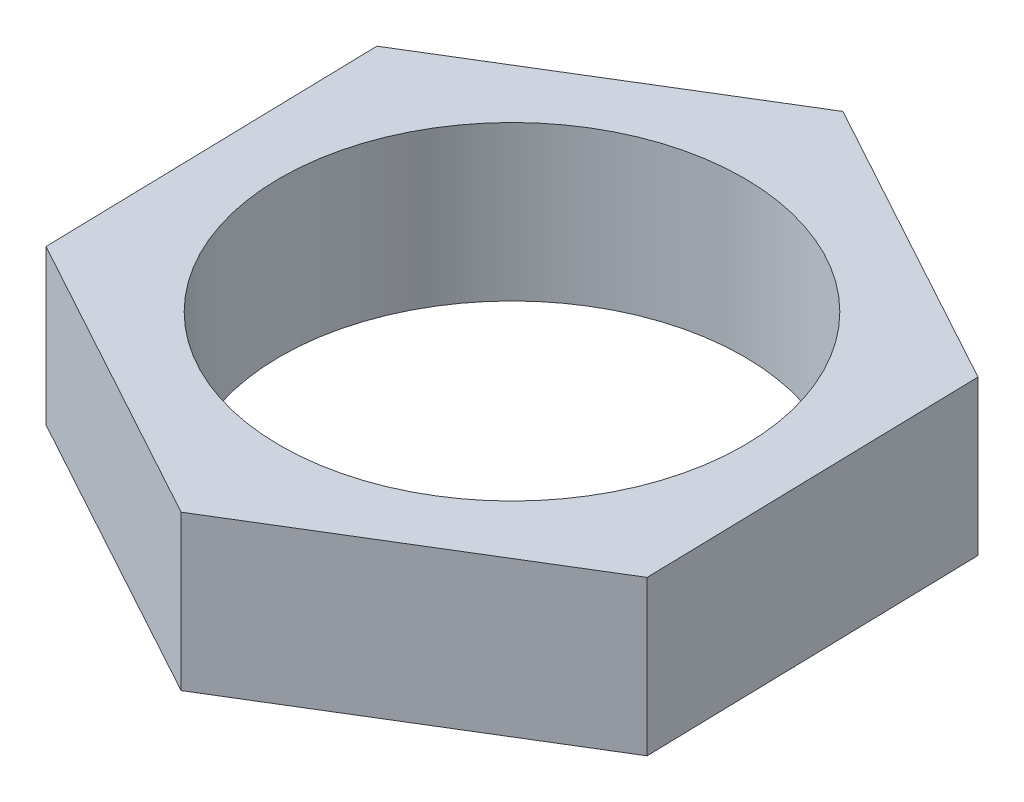
ISO-10303-21;
HEADER;
FILE_DESCRIPTION(('STEP AP214'),'2;1');
FILE_NAME('part.step','',(''),(''),'','','');
FILE_SCHEMA(('AUTOMOTIVE_DESIGN { 1 0 10303 214 1 1 1 1 }'));
ENDSEC;
DATA;
#1=APPLICATION_CONTEXT('core data for automotive mechanical design processes');
#2=APPLICATION_PROTOCOL_DEFINITION('international standard','automotive_design',2000,#1);
#3=PRODUCT_CONTEXT('',#1,'mechanical');
#4=PRODUCT('Part','Part','',(#3));
#5=PRODUCT_RELATED_PRODUCT_CATEGORY('part','',(#4));
#6=PRODUCT_DEFINITION_FORMATION('','',#4);
#7=PRODUCT_DEFINITION_CONTEXT('part definition',#1,'design');
#8=PRODUCT_DEFINITION('design','',#6,#7);
#9=PRODUCT_DEFINITION_SHAPE('','',#8);
#10=(LENGTH_UNIT() NAMED_UNIT(*) SI_UNIT(.MILLI.,.METRE.));
#11=(NAMED_UNIT(*) PLANE_ANGLE_UNIT() SI_UNIT($,.RADIAN.));
#12=(NAMED_UNIT(*) SI_UNIT($,.STERADIAN.) SOLID_ANGLE_UNIT());
#13=UNCERTAINTY_MEASURE_WITH_UNIT(LENGTH_MEASURE(1.E-05),#10,'distance_accuracy_value','');
#14=(GEOMETRIC_REPRESENTATION_CONTEXT(3) GLOBAL_UNCERTAINTY_ASSIGNED_CONTEXT((#13)) GLOBAL_UNIT_ASSIGNED_CONTEXT((#10,
#11,#12)) REPRESENTATION_CONTEXT('',''));
#15=CARTESIAN_POINT('',(0.,0.,0.));
#16=DIRECTION('',(0.,0.,1.));
#17=DIRECTION('',(1.,0.,0.));
#18=AXIS2_PLACEMENT_3D('',#15,#16,#17);
#19=CARTESIAN_POINT('',(9.36650046884318,5.,-5.70981631057372));
#20=DIRECTION('',(-0.479205511966589,0.,0.877702727180928));
#21=DIRECTION('',(0.877702727180928,0.,0.479205511966589));
#22=AXIS2_PLACEMENT_3D('',#19,#20,#21);
#23=PLANE('',#22);
#24=DIRECTION('',(-0.877702727180928,0.,-0.479205511966589));
#25=VECTOR('',#24,1.);
#26=CARTESIAN_POINT('',(9.36650046884318,0.,-5.70981631057372));
#27=LINE('',#26,#25);
#28=CARTESIAN_POINT('',(9.36650046884318,0.,-5.70981631057372));
#29=VERTEX_POINT('',#28);
#30=CARTESIAN_POINT('',(-0.261595741477986,0.,-10.9665355058639));
#31=VERTEX_POINT('',#30);
#32=EDGE_CURVE('E128',#29,#31,#27,.T.);
#33=ORIENTED_EDGE('',*,*,#32,.T.);
#34=DIRECTION('',(0.,-1.,0.));
#35=VECTOR('',#34,1.);
#36=CARTESIAN_POINT('',(-0.261595741477986,5.,-10.9665355058639));
#37=LINE('',#36,#35);
#38=CARTESIAN_POINT('',(-0.261595741477986,5.,-10.9665355058639));
#39=VERTEX_POINT('',#38);
#40=EDGE_CURVE('E11',#39,#31,#37,.T.);
#41=ORIENTED_EDGE('',*,*,#40,.F.);
#42=DIRECTION('',(-0.877702727180928,0.,-0.479205511966589));
#43=VECTOR('',#42,1.);
#44=CARTESIAN_POINT('',(9.36650046884318,5.,-5.70981631057372));
#45=LINE('',#44,#43);
#46=CARTESIAN_POINT('',(9.36650046884318,5.,-5.70981631057372));
#47=VERTEX_POINT('',#46);
#48=EDGE_CURVE('E145',#47,#39,#45,.T.);
#49=ORIENTED_EDGE('',*,*,#48,.F.);
#50=DIRECTION('',(0.,-1.,0.));
#51=VECTOR('',#50,1.);
#52=CARTESIAN_POINT('',(9.36650046884318,5.,-5.70981631057372));
#53=LINE('',#52,#51);
#54=EDGE_CURVE('E124',#47,#29,#53,.T.);
#55=ORIENTED_EDGE('',*,*,#54,.T.);
#56=EDGE_LOOP('',(#33,#41,#49,#55));
#57=FACE_BOUND('',#56,.T.);
#58=ADVANCED_FACE('F39',(#57),#23,.F.);
#59=CARTESIAN_POINT('',(-0.261595741477986,5.,-10.9665355058639));
#60=DIRECTION('',(0.520510102726272,0.,0.853855510587058));
#61=DIRECTION('',(0.853855510587058,0.,-0.520510102726272));
#62=AXIS2_PLACEMENT_3D('',#59,#60,#61);
#63=PLANE('',#62);
#64=DIRECTION('',(-0.853855510587058,0.,0.520510102726272));
#65=VECTOR('',#64,1.);
#66=CARTESIAN_POINT('',(-0.261595741477986,0.,-10.9665355058639));
#67=LINE('',#66,#65);
#68=CARTESIAN_POINT('',(-9.62809621032118,0.,-5.25671919529019));
#69=VERTEX_POINT('',#68);
#70=EDGE_CURVE('E132',#31,#69,#67,.T.);
#71=ORIENTED_EDGE('',*,*,#70,.T.);
#72=DIRECTION('',(0.,-1.,0.));
#73=VECTOR('',#72,1.);
#74=CARTESIAN_POINT('',(-9.62809621032118,5.,-5.25671919529019));
#75=LINE('',#74,#73);
#76=CARTESIAN_POINT('',(-9.62809621032118,5.,-5.25671919529019));
#77=VERTEX_POINT('',#76);
#78=EDGE_CURVE('E48',#77,#69,#75,.T.);
#79=ORIENTED_EDGE('',*,*,#78,.F.);
#80=DIRECTION('',(-0.853855510587058,0.,0.520510102726272));
#81=VECTOR('',#80,1.);
#82=CARTESIAN_POINT('',(-0.261595741477986,5.,-10.9665355058639));
#83=LINE('',#82,#81);
#84=EDGE_CURVE('E93',#39,#77,#83,.T.);
#85=ORIENTED_EDGE('',*,*,#84,.F.);
#86=ORIENTED_EDGE('',*,*,#40,.T.);
#87=EDGE_LOOP('',(#71,#79,#85,#86));
#88=FACE_BOUND('',#87,.T.);
#89=ADVANCED_FACE('F174',(#88),#63,.F.);
#90=CARTESIAN_POINT('',(-9.62809621032118,5.,-5.25671919529019));
#91=DIRECTION('',(0.999715614692861,0.,-0.0238472165938701));
#92=DIRECTION('',(-0.0238472165938701,0.,-0.999715614692861));
#93=AXIS2_PLACEMENT_3D('',#90,#91,#92);
#94=PLANE('',#93);
#95=DIRECTION('',(0.0238472165938701,0.,0.999715614692861));
#96=VECTOR('',#95,1.);
#97=CARTESIAN_POINT('',(-9.62809621032118,0.,-5.25671919529019));
#98=LINE('',#97,#96);
#99=CARTESIAN_POINT('',(-9.36650046884319,0.,5.70981631057372));
#100=VERTEX_POINT('',#99);
#101=EDGE_CURVE('E136',#69,#100,#98,.T.);
#102=ORIENTED_EDGE('',*,*,#101,.T.);
#103=DIRECTION('',(0.,-1.,0.));
#104=VECTOR('',#103,1.);
#105=CARTESIAN_POINT('',(-9.36650046884319,5.,5.70981631057372));
#106=LINE('',#105,#104);
#107=CARTESIAN_POINT('',(-9.36650046884319,5.,5.70981631057372));
#108=VERTEX_POINT('',#107);
#109=EDGE_CURVE('E117',#108,#100,#106,.T.);
#110=ORIENTED_EDGE('',*,*,#109,.F.);
#111=DIRECTION('',(0.0238472165938701,0.,0.999715614692861));
#112=VECTOR('',#111,1.);
#113=CARTESIAN_POINT('',(-9.62809621032118,5.,-5.25671919529019));
#114=LINE('',#113,#112);
#115=EDGE_CURVE('E106',#77,#108,#114,.T.);
#116=ORIENTED_EDGE('',*,*,#115,.F.);
#117=ORIENTED_EDGE('',*,*,#78,.T.);
#118=EDGE_LOOP('',(#102,#110,#116,#117));
#119=FACE_BOUND('',#118,.T.);
#120=ADVANCED_FACE('F155',(#119),#94,.F.);
#121=CARTESIAN_POINT('',(-9.36650046884319,5.,5.70981631057372));
#122=DIRECTION('',(0.47920551196659,0.,-0.877702727180928));
#123=DIRECTION('',(-0.877702727180928,0.,-0.479205511966589));
#124=AXIS2_PLACEMENT_3D('',#121,#122,#123);
#125=PLANE('',#124);
#126=DIRECTION('',(0.877702727180928,0.,0.47920551196659));
#127=VECTOR('',#126,1.);
#128=CARTESIAN_POINT('',(-9.36650046884319,0.,5.70981631057372));
#129=LINE('',#128,#127);
#130=CARTESIAN_POINT('',(0.261595741477987,0.,10.9665355058639));
#131=VERTEX_POINT('',#130);
#132=EDGE_CURVE('E115',#100,#131,#129,.T.);
#133=ORIENTED_EDGE('',*,*,#132,.T.);
#134=DIRECTION('',(0.,-1.,0.));
#135=VECTOR('',#134,1.);
#136=CARTESIAN_POINT('',(0.261595741477987,5.,10.9665355058639));
#137=LINE('',#136,#135);
#138=CARTESIAN_POINT('',(0.261595741477987,5.,10.9665355058639));
#139=VERTEX_POINT('',#138);
#140=EDGE_CURVE('E112',#139,#131,#137,.T.);
#141=ORIENTED_EDGE('',*,*,#140,.F.);
#142=DIRECTION('',(0.877702727180928,0.,0.47920551196659));
#143=VECTOR('',#142,1.);
#144=CARTESIAN_POINT('',(-9.36650046884319,5.,5.70981631057372));
#145=LINE('',#144,#143);
#146=EDGE_CURVE('E100',#108,#139,#145,.T.);
#147=ORIENTED_EDGE('',*,*,#146,.F.);
#148=ORIENTED_EDGE('',*,*,#109,.T.);
#149=EDGE_LOOP('',(#133,#141,#147,#148));
#150=FACE_BOUND('',#149,.T.);
#151=ADVANCED_FACE('F113',(#150),#125,.F.);
#152=CARTESIAN_POINT('',(0.261595741477987,5.,10.9665355058639));
#153=DIRECTION('',(-0.520510102726272,0.,-0.853855510587058));
#154=DIRECTION('',(-0.853855510587058,0.,0.520510102726272));
#155=AXIS2_PLACEMENT_3D('',#152,#153,#154);
#156=PLANE('',#155);
#157=DIRECTION('',(0.853855510587058,0.,-0.520510102726272));
#158=VECTOR('',#157,1.);
#159=CARTESIAN_POINT('',(0.261595741477987,0.,10.9665355058639));
#160=LINE('',#159,#158);
#161=CARTESIAN_POINT('',(9.62809621032118,0.,5.25671919529019));
#162=VERTEX_POINT('',#161);
#163=EDGE_CURVE('E79',#131,#162,#160,.T.);
#164=ORIENTED_EDGE('',*,*,#163,.T.);
#165=DIRECTION('',(0.,-1.,0.));
#166=VECTOR('',#165,1.);
#167=CARTESIAN_POINT('',(9.62809621032118,5.,5.25671919529019));
#168=LINE('',#167,#166);
#169=CARTESIAN_POINT('',(9.62809621032118,5.,5.25671919529019));
#170=VERTEX_POINT('',#169);
#171=EDGE_CURVE('E118',#170,#162,#168,.T.);
#172=ORIENTED_EDGE('',*,*,#171,.F.);
#173=DIRECTION('',(0.853855510587058,0.,-0.520510102726272));
#174=VECTOR('',#173,1.);
#175=CARTESIAN_POINT('',(0.261595741477987,5.,10.9665355058639));
#176=LINE('',#175,#174);
#177=EDGE_CURVE('E104',#139,#170,#176,.T.);
#178=ORIENTED_EDGE('',*,*,#177,.F.);
#179=ORIENTED_EDGE('',*,*,#140,.T.);
#180=EDGE_LOOP('',(#164,#172,#178,#179));
#181=FACE_BOUND('',#180,.T.);
#182=ADVANCED_FACE('F120',(#181),#156,.F.);
#183=CARTESIAN_POINT('',(9.62809621032118,5.,5.25671919529019));
#184=DIRECTION('',(-0.999715614692861,0.,0.0238472165938704));
#185=DIRECTION('',(0.0238472165938704,0.,0.999715614692861));
#186=AXIS2_PLACEMENT_3D('',#183,#184,#185);
#187=PLANE('',#186);
#188=DIRECTION('',(-0.0238472165938704,0.,-0.999715614692861));
#189=VECTOR('',#188,1.);
#190=CARTESIAN_POINT('',(9.62809621032118,0.,5.25671919529019));
#191=LINE('',#190,#189);
#192=EDGE_CURVE('E85',#162,#29,#191,.T.);
#193=ORIENTED_EDGE('',*,*,#192,.T.);
#194=ORIENTED_EDGE('',*,*,#54,.F.);
#195=DIRECTION('',(-0.0238472165938704,0.,-0.999715614692861));
#196=VECTOR('',#195,1.);
#197=CARTESIAN_POINT('',(9.62809621032118,5.,5.25671919529019));
#198=LINE('',#197,#196);
#199=EDGE_CURVE('E56',#170,#47,#198,.T.);
#200=ORIENTED_EDGE('',*,*,#199,.F.);
#201=ORIENTED_EDGE('',*,*,#171,.T.);
#202=EDGE_LOOP('',(#193,#194,#200,#201));
#203=FACE_BOUND('',#202,.T.);
#204=ADVANCED_FACE('F162',(#203),#187,.F.);
#205=CARTESIAN_POINT('',(0.,5.,0.));
#206=DIRECTION('',(0.,1.,0.));
#207=DIRECTION('',(0.,0.,1.));
#208=AXIS2_PLACEMENT_3D('',#205,#206,#207);
#209=PLANE('',#208);
#210=CARTESIAN_POINT('',(0.,5.,0.));
#211=DIRECTION('',(0.,1.,0.));
#212=DIRECTION('',(0.,0.,1.));
#213=AXIS2_PLACEMENT_3D('',#210,#211,#212);
#214=CIRCLE('',#213,7.50000000000002);
#215=CARTESIAN_POINT('',(0.,5.,7.50000000000002));
#216=VERTEX_POINT('',#215);
#217=EDGE_CURVE('E229',#216,#216,#214,.T.);
#218=ORIENTED_EDGE('',*,*,#217,.F.);
#219=EDGE_LOOP('',(#218));
#220=FACE_BOUND('',#219,.T.);
#221=ORIENTED_EDGE('',*,*,#48,.T.);
#222=ORIENTED_EDGE('',*,*,#84,.T.);
#223=ORIENTED_EDGE('',*,*,#115,.T.);
#224=ORIENTED_EDGE('',*,*,#146,.T.);
#225=ORIENTED_EDGE('',*,*,#177,.T.);
#226=ORIENTED_EDGE('',*,*,#199,.T.);
#227=EDGE_LOOP('',(#221,#222,#223,#224,#225,#226));
#228=FACE_BOUND('',#227,.T.);
#229=ADVANCED_FACE('F102',(#220,#228),#209,.T.);
#230=CARTESIAN_POINT('',(0.,0.,0.));
#231=DIRECTION('',(0.,1.,0.));
#232=DIRECTION('',(0.,0.,1.));
#233=AXIS2_PLACEMENT_3D('',#230,#231,#232);
#234=PLANE('',#233);
#235=CARTESIAN_POINT('',(0.,0.,0.));
#236=DIRECTION('',(0.,1.,0.));
#237=DIRECTION('',(0.,0.,1.));
#238=AXIS2_PLACEMENT_3D('',#235,#236,#237);
#239=CIRCLE('',#238,7.50000000000002);
#240=CARTESIAN_POINT('',(0.,0.,7.50000000000002));
#241=VERTEX_POINT('',#240);
#242=EDGE_CURVE('E133',#241,#241,#239,.T.);
#243=ORIENTED_EDGE('',*,*,#242,.T.);
#244=EDGE_LOOP('',(#243));
#245=FACE_BOUND('',#244,.T.);
#246=ORIENTED_EDGE('',*,*,#32,.F.);
#247=ORIENTED_EDGE('',*,*,#192,.F.);
#248=ORIENTED_EDGE('',*,*,#163,.F.);
#249=ORIENTED_EDGE('',*,*,#132,.F.);
#250=ORIENTED_EDGE('',*,*,#101,.F.);
#251=ORIENTED_EDGE('',*,*,#70,.F.);
#252=EDGE_LOOP('',(#246,#247,#248,#249,#250,#251));
#253=FACE_BOUND('',#252,.T.);
#254=ADVANCED_FACE('F158',(#245,#253),#234,.F.);
#255=CARTESIAN_POINT('',(0.,0.,0.));
#256=DIRECTION('',(0.,1.,0.));
#257=DIRECTION('',(0.,0.,1.));
#258=AXIS2_PLACEMENT_3D('',#255,#256,#257);
#259=CYLINDRICAL_SURFACE('',#258,7.50000000000002);
#260=ORIENTED_EDGE('',*,*,#242,.F.);
#261=EDGE_LOOP('',(#260));
#262=FACE_BOUND('',#261,.T.);
#263=ORIENTED_EDGE('',*,*,#217,.T.);
#264=EDGE_LOOP('',(#263));
#265=FACE_BOUND('',#264,.T.);
#266=ADVANCED_FACE('F211',(#262,#265),#259,.F.);
#267=CLOSED_SHELL('',(#58,#89,#120,#151,#182,#204,#229,#254,#266));
#268=MANIFOLD_SOLID_BREP('B2',#267);
#269=ADVANCED_BREP_SHAPE_REPRESENTATION('',(#18,#268),#14);
#270=SHAPE_DEFINITION_REPRESENTATION(#9,#269);
ENDSEC;
END-ISO-10303-21;
